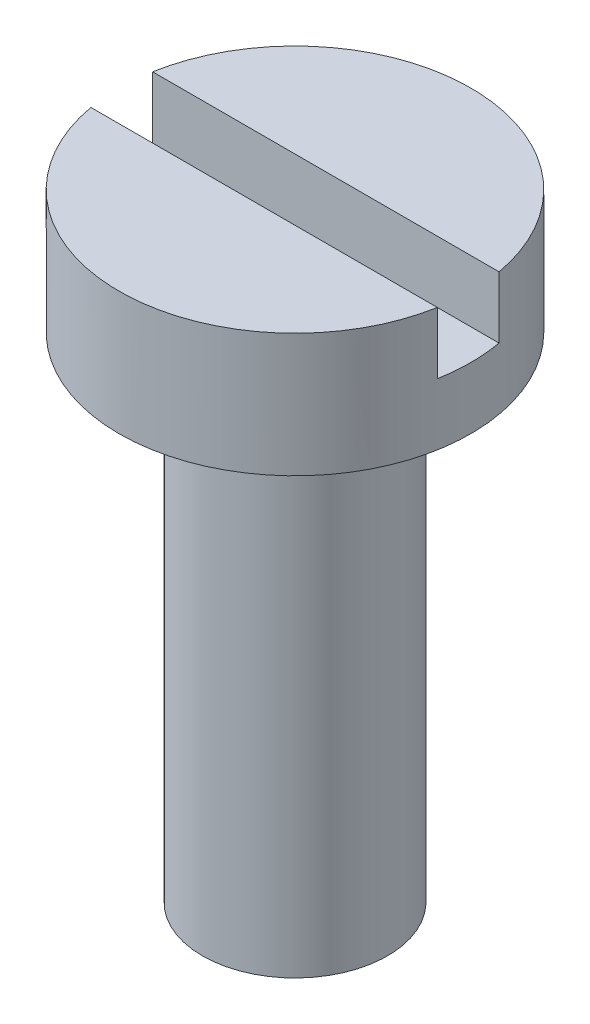
ISO-10303-21;
HEADER;
FILE_DESCRIPTION(('STEP AP214'),'2;1');
FILE_NAME('part.step','',(''),(''),'','','');
FILE_SCHEMA(('AUTOMOTIVE_DESIGN { 1 0 10303 214 1 1 1 1 }'));
ENDSEC;
DATA;
#1=APPLICATION_CONTEXT('core data for automotive mechanical design processes');
#2=APPLICATION_PROTOCOL_DEFINITION('international standard','automotive_design',2000,#1);
#3=PRODUCT_CONTEXT('',#1,'mechanical');
#4=PRODUCT('Part','Part','',(#3));
#5=PRODUCT_RELATED_PRODUCT_CATEGORY('part','',(#4));
#6=PRODUCT_DEFINITION_FORMATION('','',#4);
#7=PRODUCT_DEFINITION_CONTEXT('part definition',#1,'design');
#8=PRODUCT_DEFINITION('design','',#6,#7);
#9=PRODUCT_DEFINITION_SHAPE('','',#8);
#10=(LENGTH_UNIT() NAMED_UNIT(*) SI_UNIT(.MILLI.,.METRE.));
#11=(NAMED_UNIT(*) PLANE_ANGLE_UNIT() SI_UNIT($,.RADIAN.));
#12=(NAMED_UNIT(*) SI_UNIT($,.STERADIAN.) SOLID_ANGLE_UNIT());
#13=UNCERTAINTY_MEASURE_WITH_UNIT(LENGTH_MEASURE(1.E-05),#10,'distance_accuracy_value','');
#14=(GEOMETRIC_REPRESENTATION_CONTEXT(3) GLOBAL_UNCERTAINTY_ASSIGNED_CONTEXT((#13)) GLOBAL_UNIT_ASSIGNED_CONTEXT((#10,
#11,#12)) REPRESENTATION_CONTEXT('',''));
#15=CARTESIAN_POINT('',(0.,0.,0.));
#16=DIRECTION('',(0.,0.,1.));
#17=DIRECTION('',(1.,0.,0.));
#18=AXIS2_PLACEMENT_3D('',#15,#16,#17);
#19=CARTESIAN_POINT('',(0.,2.,0.));
#20=DIRECTION('',(0.,1.,0.));
#21=DIRECTION('',(0.,0.,1.));
#22=AXIS2_PLACEMENT_3D('',#19,#20,#21);
#23=PLANE('',#22);
#24=DIRECTION('',(1.,0.,0.));
#25=VECTOR('',#24,1.);
#26=CARTESIAN_POINT('',(0.,2.,0.5));
#27=LINE('',#26,#25);
#28=CARTESIAN_POINT('',(-2.80579756931964,2.,0.5));
#29=VERTEX_POINT('',#28);
#30=CARTESIAN_POINT('',(2.80579756931964,2.,0.5));
#31=VERTEX_POINT('',#30);
#32=EDGE_CURVE('E82',#29,#31,#27,.T.);
#33=ORIENTED_EDGE('',*,*,#32,.F.);
#34=CARTESIAN_POINT('',(0.,2.,0.));
#35=DIRECTION('',(0.,1.,0.));
#36=DIRECTION('',(0.,0.,1.));
#37=AXIS2_PLACEMENT_3D('',#34,#35,#36);
#38=CIRCLE('',#37,2.85);
#39=EDGE_CURVE('E92',#29,#31,#38,.T.);
#40=ORIENTED_EDGE('',*,*,#39,.T.);
#41=EDGE_LOOP('',(#33,#40));
#42=FACE_BOUND('',#41,.T.);
#43=ADVANCED_FACE('F34',(#42),#23,.T.);
#44=CARTESIAN_POINT('',(0.,2.,0.));
#45=DIRECTION('',(0.,-1.,0.));
#46=DIRECTION('',(0.,0.,-1.));
#47=AXIS2_PLACEMENT_3D('',#44,#45,#46);
#48=CYLINDRICAL_SURFACE('',#47,2.85);
#49=CARTESIAN_POINT('',(0.,1.,0.));
#50=DIRECTION('',(0.,-1.,0.));
#51=DIRECTION('',(0.,0.,-1.));
#52=AXIS2_PLACEMENT_3D('',#49,#50,#51);
#53=CIRCLE('',#52,2.85);
#54=CARTESIAN_POINT('',(2.80579756931964,1.,-0.5));
#55=VERTEX_POINT('',#54);
#56=CARTESIAN_POINT('',(2.80579756931964,1.,0.5));
#57=VERTEX_POINT('',#56);
#58=EDGE_CURVE('E11',#55,#57,#53,.T.);
#59=ORIENTED_EDGE('',*,*,#58,.T.);
#60=DIRECTION('',(0.,-1.,0.));
#61=VECTOR('',#60,1.);
#62=CARTESIAN_POINT('',(2.80579756931964,2.,0.5));
#63=LINE('',#62,#61);
#64=EDGE_CURVE('E57',#57,#31,#63,.F.);
#65=ORIENTED_EDGE('',*,*,#64,.T.);
#66=ORIENTED_EDGE('',*,*,#39,.F.);
#67=DIRECTION('',(0.,-1.,0.));
#68=VECTOR('',#67,1.);
#69=CARTESIAN_POINT('',(-2.80579756931964,2.,0.5));
#70=LINE('',#69,#68);
#71=CARTESIAN_POINT('',(-2.80579756931964,1.,0.5));
#72=VERTEX_POINT('',#71);
#73=EDGE_CURVE('E104',#29,#72,#70,.T.);
#74=ORIENTED_EDGE('',*,*,#73,.T.);
#75=CARTESIAN_POINT('',(-2.80579756931964,1.,-0.5));
#76=VERTEX_POINT('',#75);
#77=EDGE_CURVE('E38',#72,#76,#53,.T.);
#78=ORIENTED_EDGE('',*,*,#77,.T.);
#79=DIRECTION('',(0.,-1.,0.));
#80=VECTOR('',#79,1.);
#81=CARTESIAN_POINT('',(-2.80579756931964,2.,-0.5));
#82=LINE('',#81,#80);
#83=CARTESIAN_POINT('',(-2.80579756931964,2.,-0.5));
#84=VERTEX_POINT('',#83);
#85=EDGE_CURVE('E77',#76,#84,#82,.F.);
#86=ORIENTED_EDGE('',*,*,#85,.T.);
#87=CARTESIAN_POINT('',(2.80579756931964,2.,-0.5));
#88=VERTEX_POINT('',#87);
#89=EDGE_CURVE('E83',#88,#84,#38,.T.);
#90=ORIENTED_EDGE('',*,*,#89,.F.);
#91=DIRECTION('',(0.,-1.,0.));
#92=VECTOR('',#91,1.);
#93=CARTESIAN_POINT('',(2.80579756931964,2.,-0.5));
#94=LINE('',#93,#92);
#95=EDGE_CURVE('E49',#88,#55,#94,.T.);
#96=ORIENTED_EDGE('',*,*,#95,.T.);
#97=EDGE_LOOP('',(#59,#65,#66,#74,#78,#86,#90,#96));
#98=FACE_BOUND('',#97,.T.);
#99=CARTESIAN_POINT('',(0.,0.,0.));
#100=DIRECTION('',(0.,1.,0.));
#101=DIRECTION('',(0.,0.,1.));
#102=AXIS2_PLACEMENT_3D('',#99,#100,#101);
#103=CIRCLE('',#102,2.85);
#104=CARTESIAN_POINT('',(0.,0.,2.85));
#105=VERTEX_POINT('',#104);
#106=EDGE_CURVE('E95',#105,#105,#103,.T.);
#107=ORIENTED_EDGE('',*,*,#106,.T.);
#108=EDGE_LOOP('',(#107));
#109=FACE_BOUND('',#108,.T.);
#110=ADVANCED_FACE('F36',(#98,#109),#48,.T.);
#111=DIRECTION('',(-1.,0.,0.));
#112=VECTOR('',#111,1.);
#113=CARTESIAN_POINT('',(0.,2.,-0.5));
#114=LINE('',#113,#112);
#115=EDGE_CURVE('E74',#88,#84,#114,.T.);
#116=ORIENTED_EDGE('',*,*,#115,.F.);
#117=ORIENTED_EDGE('',*,*,#89,.T.);
#118=EDGE_LOOP('',(#116,#117));
#119=FACE_BOUND('',#118,.T.);
#120=ADVANCED_FACE('F91',(#119),#23,.T.);
#121=CARTESIAN_POINT('',(0.,0.,0.));
#122=DIRECTION('',(0.,1.,0.));
#123=DIRECTION('',(0.,0.,1.));
#124=AXIS2_PLACEMENT_3D('',#121,#122,#123);
#125=PLANE('',#124);
#126=CARTESIAN_POINT('',(0.,0.,0.));
#127=DIRECTION('',(0.,1.,0.));
#128=DIRECTION('',(0.,0.,1.));
#129=AXIS2_PLACEMENT_3D('',#126,#127,#128);
#130=CIRCLE('',#129,1.5);
#131=CARTESIAN_POINT('',(0.,0.,1.5));
#132=VERTEX_POINT('',#131);
#133=EDGE_CURVE('E98',#132,#132,#130,.T.);
#134=ORIENTED_EDGE('',*,*,#133,.T.);
#135=EDGE_LOOP('',(#134));
#136=FACE_BOUND('',#135,.T.);
#137=ORIENTED_EDGE('',*,*,#106,.F.);
#138=EDGE_LOOP('',(#137));
#139=FACE_BOUND('',#138,.T.);
#140=ADVANCED_FACE('F115',(#136,#139),#125,.F.);
#141=CARTESIAN_POINT('',(0.,-8.,0.));
#142=DIRECTION('',(0.,1.,0.));
#143=DIRECTION('',(0.,0.,1.));
#144=AXIS2_PLACEMENT_3D('',#141,#142,#143);
#145=CYLINDRICAL_SURFACE('',#144,1.5);
#146=CARTESIAN_POINT('',(0.,-8.,0.));
#147=DIRECTION('',(0.,1.,0.));
#148=DIRECTION('',(0.,0.,1.));
#149=AXIS2_PLACEMENT_3D('',#146,#147,#148);
#150=CIRCLE('',#149,1.5);
#151=CARTESIAN_POINT('',(0.,-8.,1.5));
#152=VERTEX_POINT('',#151);
#153=EDGE_CURVE('E101',#152,#152,#150,.T.);
#154=ORIENTED_EDGE('',*,*,#153,.T.);
#155=EDGE_LOOP('',(#154));
#156=FACE_BOUND('',#155,.T.);
#157=ORIENTED_EDGE('',*,*,#133,.F.);
#158=EDGE_LOOP('',(#157));
#159=FACE_BOUND('',#158,.T.);
#160=ADVANCED_FACE('F119',(#156,#159),#145,.T.);
#161=CARTESIAN_POINT('',(0.,-8.,0.));
#162=DIRECTION('',(0.,1.,0.));
#163=DIRECTION('',(0.,0.,1.));
#164=AXIS2_PLACEMENT_3D('',#161,#162,#163);
#165=PLANE('',#164);
#166=ORIENTED_EDGE('',*,*,#153,.F.);
#167=EDGE_LOOP('',(#166));
#168=FACE_BOUND('',#167,.T.);
#169=ADVANCED_FACE('F124',(#168),#165,.F.);
#170=CARTESIAN_POINT('',(0.,1.,0.));
#171=DIRECTION('',(0.,-1.,0.));
#172=DIRECTION('',(0.,0.,-1.));
#173=AXIS2_PLACEMENT_3D('',#170,#171,#172);
#174=PLANE('',#173);
#175=DIRECTION('',(-1.,0.,0.));
#176=VECTOR('',#175,1.);
#177=CARTESIAN_POINT('',(-3.,1.,-0.5));
#178=LINE('',#177,#176);
#179=EDGE_CURVE('E136',#55,#76,#178,.T.);
#180=ORIENTED_EDGE('',*,*,#179,.T.);
#181=ORIENTED_EDGE('',*,*,#77,.F.);
#182=DIRECTION('',(1.,0.,0.));
#183=VECTOR('',#182,1.);
#184=CARTESIAN_POINT('',(-3.,1.,0.5));
#185=LINE('',#184,#183);
#186=EDGE_CURVE('E89',#72,#57,#185,.T.);
#187=ORIENTED_EDGE('',*,*,#186,.T.);
#188=ORIENTED_EDGE('',*,*,#58,.F.);
#189=EDGE_LOOP('',(#180,#181,#187,#188));
#190=FACE_BOUND('',#189,.T.);
#191=ADVANCED_FACE('F138',(#190),#174,.F.);
#192=CARTESIAN_POINT('',(-3.,1.,0.5));
#193=DIRECTION('',(0.,0.,1.));
#194=DIRECTION('',(1.,0.,0.));
#195=AXIS2_PLACEMENT_3D('',#192,#193,#194);
#196=PLANE('',#195);
#197=ORIENTED_EDGE('',*,*,#32,.T.);
#198=ORIENTED_EDGE('',*,*,#64,.F.);
#199=ORIENTED_EDGE('',*,*,#186,.F.);
#200=ORIENTED_EDGE('',*,*,#73,.F.);
#201=EDGE_LOOP('',(#197,#198,#199,#200));
#202=FACE_BOUND('',#201,.T.);
#203=ADVANCED_FACE('F103',(#202),#196,.F.);
#204=CARTESIAN_POINT('',(-3.,1.,-0.5));
#205=DIRECTION('',(0.,0.,-1.));
#206=DIRECTION('',(-1.,0.,0.));
#207=AXIS2_PLACEMENT_3D('',#204,#205,#206);
#208=PLANE('',#207);
#209=ORIENTED_EDGE('',*,*,#115,.T.);
#210=ORIENTED_EDGE('',*,*,#85,.F.);
#211=ORIENTED_EDGE('',*,*,#179,.F.);
#212=ORIENTED_EDGE('',*,*,#95,.F.);
#213=EDGE_LOOP('',(#209,#210,#211,#212));
#214=FACE_BOUND('',#213,.T.);
#215=ADVANCED_FACE('F76',(#214),#208,.F.);
#216=CLOSED_SHELL('',(#43,#110,#120,#140,#160,#169,#191,#203,#215));
#217=MANIFOLD_SOLID_BREP('B2',#216);
#218=ADVANCED_BREP_SHAPE_REPRESENTATION('',(#18,#217),#14);
#219=SHAPE_DEFINITION_REPRESENTATION(#9,#218);
ENDSEC;
END-ISO-10303-21;
